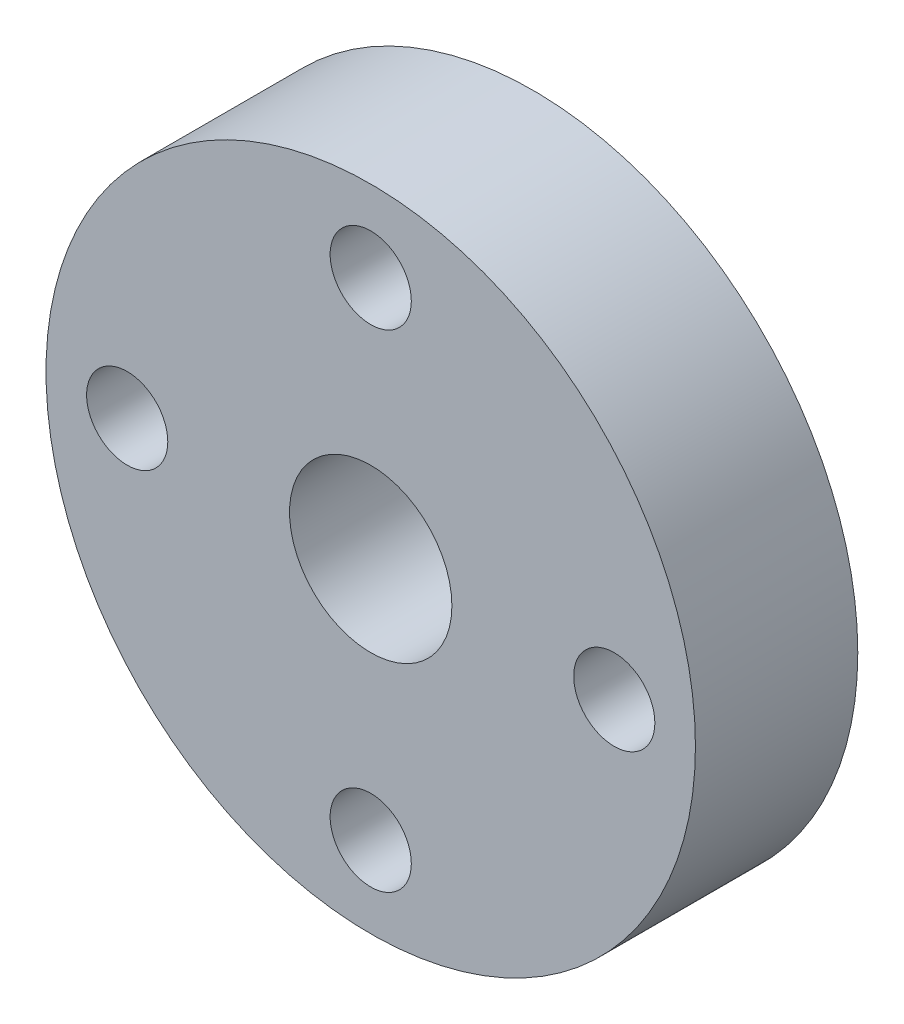
ISO-10303-21;
HEADER;
FILE_DESCRIPTION(('STEP AP214'),'2;1');
FILE_NAME('part.step','',(''),(''),'','','');
FILE_SCHEMA(('AUTOMOTIVE_DESIGN { 1 0 10303 214 1 1 1 1 }'));
ENDSEC;
DATA;
#1=APPLICATION_CONTEXT('core data for automotive mechanical design processes');
#2=APPLICATION_PROTOCOL_DEFINITION('international standard','automotive_design',2000,#1);
#3=PRODUCT_CONTEXT('',#1,'mechanical');
#4=PRODUCT('Part','Part','',(#3));
#5=PRODUCT_RELATED_PRODUCT_CATEGORY('part','',(#4));
#6=PRODUCT_DEFINITION_FORMATION('','',#4);
#7=PRODUCT_DEFINITION_CONTEXT('part definition',#1,'design');
#8=PRODUCT_DEFINITION('design','',#6,#7);
#9=PRODUCT_DEFINITION_SHAPE('','',#8);
#10=(LENGTH_UNIT() NAMED_UNIT(*) SI_UNIT(.MILLI.,.METRE.));
#11=(NAMED_UNIT(*) PLANE_ANGLE_UNIT() SI_UNIT($,.RADIAN.));
#12=(NAMED_UNIT(*) SI_UNIT($,.STERADIAN.) SOLID_ANGLE_UNIT());
#13=UNCERTAINTY_MEASURE_WITH_UNIT(LENGTH_MEASURE(1.E-05),#10,'distance_accuracy_value','');
#14=(GEOMETRIC_REPRESENTATION_CONTEXT(3) GLOBAL_UNCERTAINTY_ASSIGNED_CONTEXT((#13)) GLOBAL_UNIT_ASSIGNED_CONTEXT((#10,
#11,#12)) REPRESENTATION_CONTEXT('',''));
#15=CARTESIAN_POINT('',(0.,0.,0.));
#16=DIRECTION('',(0.,0.,1.));
#17=DIRECTION('',(1.,0.,0.));
#18=AXIS2_PLACEMENT_3D('',#15,#16,#17);
#19=CARTESIAN_POINT('',(0.,0.,10.));
#20=DIRECTION('',(0.,0.,1.));
#21=DIRECTION('',(1.,0.,0.));
#22=AXIS2_PLACEMENT_3D('',#19,#20,#21);
#23=PLANE('',#22);
#24=CARTESIAN_POINT('',(0.,-15.,10.));
#25=DIRECTION('',(0.,0.,1.));
#26=DIRECTION('',(1.,0.,0.));
#27=AXIS2_PLACEMENT_3D('',#24,#25,#26);
#28=CIRCLE('',#27,2.5000000000001);
#29=CARTESIAN_POINT('',(2.5000000000001,-15.,10.));
#30=VERTEX_POINT('',#29);
#31=EDGE_CURVE('E59',#30,#30,#28,.T.);
#32=ORIENTED_EDGE('',*,*,#31,.F.);
#33=EDGE_LOOP('',(#32));
#34=FACE_BOUND('',#33,.T.);
#35=CARTESIAN_POINT('',(0.,15.,10.));
#36=DIRECTION('',(0.,0.,1.));
#37=DIRECTION('',(1.,0.,0.));
#38=AXIS2_PLACEMENT_3D('',#35,#36,#37);
#39=CIRCLE('',#38,2.5);
#40=CARTESIAN_POINT('',(2.5,15.,10.));
#41=VERTEX_POINT('',#40);
#42=EDGE_CURVE('E47',#41,#41,#39,.T.);
#43=ORIENTED_EDGE('',*,*,#42,.F.);
#44=EDGE_LOOP('',(#43));
#45=FACE_BOUND('',#44,.T.);
#46=CARTESIAN_POINT('',(0.,0.,10.));
#47=DIRECTION('',(0.,0.,1.));
#48=DIRECTION('',(1.,0.,0.));
#49=AXIS2_PLACEMENT_3D('',#46,#47,#48);
#50=CIRCLE('',#49,20.);
#51=CARTESIAN_POINT('',(20.,0.,10.));
#52=VERTEX_POINT('',#51);
#53=EDGE_CURVE('E10',#52,#52,#50,.T.);
#54=ORIENTED_EDGE('',*,*,#53,.T.);
#55=EDGE_LOOP('',(#54));
#56=FACE_BOUND('',#55,.T.);
#57=CARTESIAN_POINT('',(0.,0.,10.));
#58=DIRECTION('',(0.,0.,1.));
#59=DIRECTION('',(1.,0.,0.));
#60=AXIS2_PLACEMENT_3D('',#57,#58,#59);
#61=CIRCLE('',#60,5.);
#62=CARTESIAN_POINT('',(5.,0.,10.));
#63=VERTEX_POINT('',#62);
#64=EDGE_CURVE('E42',#63,#63,#61,.T.);
#65=ORIENTED_EDGE('',*,*,#64,.F.);
#66=EDGE_LOOP('',(#65));
#67=FACE_BOUND('',#66,.T.);
#68=CARTESIAN_POINT('',(15.0000000000004,4.24488671257339E-13,10.));
#69=DIRECTION('',(0.,0.,1.));
#70=DIRECTION('',(1.,0.,0.));
#71=AXIS2_PLACEMENT_3D('',#68,#69,#70);
#72=CIRCLE('',#71,2.50000000000033);
#73=CARTESIAN_POINT('',(17.5000000000008,4.24488671257339E-13,10.));
#74=VERTEX_POINT('',#73);
#75=EDGE_CURVE('E53',#74,#74,#72,.T.);
#76=ORIENTED_EDGE('',*,*,#75,.F.);
#77=EDGE_LOOP('',(#76));
#78=FACE_BOUND('',#77,.T.);
#79=CARTESIAN_POINT('',(-15.,0.,10.));
#80=DIRECTION('',(0.,0.,1.));
#81=DIRECTION('',(1.,0.,0.));
#82=AXIS2_PLACEMENT_3D('',#79,#80,#81);
#83=CIRCLE('',#82,2.50000000000015);
#84=CARTESIAN_POINT('',(-12.4999999999999,0.,10.));
#85=VERTEX_POINT('',#84);
#86=EDGE_CURVE('E65',#85,#85,#83,.T.);
#87=ORIENTED_EDGE('',*,*,#86,.F.);
#88=EDGE_LOOP('',(#87));
#89=FACE_BOUND('',#88,.T.);
#90=ADVANCED_FACE('F31',(#34,#45,#56,#67,#78,#89),#23,.T.);
#91=CARTESIAN_POINT('',(0.,0.,0.));
#92=DIRECTION('',(0.,0.,1.));
#93=DIRECTION('',(1.,0.,0.));
#94=AXIS2_PLACEMENT_3D('',#91,#92,#93);
#95=PLANE('',#94);
#96=CARTESIAN_POINT('',(0.,0.,0.));
#97=DIRECTION('',(0.,0.,1.));
#98=DIRECTION('',(1.,0.,0.));
#99=AXIS2_PLACEMENT_3D('',#96,#97,#98);
#100=CIRCLE('',#99,20.);
#101=CARTESIAN_POINT('',(20.,0.,0.));
#102=VERTEX_POINT('',#101);
#103=EDGE_CURVE('E35',#102,#102,#100,.T.);
#104=ORIENTED_EDGE('',*,*,#103,.F.);
#105=EDGE_LOOP('',(#104));
#106=FACE_BOUND('',#105,.T.);
#107=CARTESIAN_POINT('',(0.,0.,0.));
#108=DIRECTION('',(0.,0.,1.));
#109=DIRECTION('',(1.,0.,0.));
#110=AXIS2_PLACEMENT_3D('',#107,#108,#109);
#111=CIRCLE('',#110,5.);
#112=CARTESIAN_POINT('',(5.,0.,0.));
#113=VERTEX_POINT('',#112);
#114=EDGE_CURVE('E44',#113,#113,#111,.T.);
#115=ORIENTED_EDGE('',*,*,#114,.T.);
#116=EDGE_LOOP('',(#115));
#117=FACE_BOUND('',#116,.T.);
#118=CARTESIAN_POINT('',(0.,15.,0.));
#119=DIRECTION('',(0.,0.,1.));
#120=DIRECTION('',(1.,0.,0.));
#121=AXIS2_PLACEMENT_3D('',#118,#119,#120);
#122=CIRCLE('',#121,2.5);
#123=CARTESIAN_POINT('',(2.5,15.,0.));
#124=VERTEX_POINT('',#123);
#125=EDGE_CURVE('E50',#124,#124,#122,.T.);
#126=ORIENTED_EDGE('',*,*,#125,.T.);
#127=EDGE_LOOP('',(#126));
#128=FACE_BOUND('',#127,.T.);
#129=CARTESIAN_POINT('',(15.0000000000004,4.24488671257339E-13,0.));
#130=DIRECTION('',(0.,0.,1.));
#131=DIRECTION('',(1.,0.,0.));
#132=AXIS2_PLACEMENT_3D('',#129,#130,#131);
#133=CIRCLE('',#132,2.50000000000033);
#134=CARTESIAN_POINT('',(17.5000000000008,4.24488671257339E-13,0.));
#135=VERTEX_POINT('',#134);
#136=EDGE_CURVE('E56',#135,#135,#133,.T.);
#137=ORIENTED_EDGE('',*,*,#136,.T.);
#138=EDGE_LOOP('',(#137));
#139=FACE_BOUND('',#138,.T.);
#140=CARTESIAN_POINT('',(0.,-15.,0.));
#141=DIRECTION('',(0.,0.,1.));
#142=DIRECTION('',(1.,0.,0.));
#143=AXIS2_PLACEMENT_3D('',#140,#141,#142);
#144=CIRCLE('',#143,2.5000000000001);
#145=CARTESIAN_POINT('',(2.5000000000001,-15.,0.));
#146=VERTEX_POINT('',#145);
#147=EDGE_CURVE('E62',#146,#146,#144,.T.);
#148=ORIENTED_EDGE('',*,*,#147,.T.);
#149=EDGE_LOOP('',(#148));
#150=FACE_BOUND('',#149,.T.);
#151=CARTESIAN_POINT('',(-15.,0.,0.));
#152=DIRECTION('',(0.,0.,1.));
#153=DIRECTION('',(1.,0.,0.));
#154=AXIS2_PLACEMENT_3D('',#151,#152,#153);
#155=CIRCLE('',#154,2.50000000000015);
#156=CARTESIAN_POINT('',(-12.4999999999999,0.,0.));
#157=VERTEX_POINT('',#156);
#158=EDGE_CURVE('E68',#157,#157,#155,.T.);
#159=ORIENTED_EDGE('',*,*,#158,.T.);
#160=EDGE_LOOP('',(#159));
#161=FACE_BOUND('',#160,.T.);
#162=ADVANCED_FACE('F78',(#106,#117,#128,#139,#150,#161),#95,.F.);
#163=CARTESIAN_POINT('',(0.,0.,10.));
#164=DIRECTION('',(0.,0.,-1.));
#165=DIRECTION('',(-1.,0.,0.));
#166=AXIS2_PLACEMENT_3D('',#163,#164,#165);
#167=CYLINDRICAL_SURFACE('',#166,20.);
#168=ORIENTED_EDGE('',*,*,#53,.F.);
#169=EDGE_LOOP('',(#168));
#170=FACE_BOUND('',#169,.T.);
#171=ORIENTED_EDGE('',*,*,#103,.T.);
#172=EDGE_LOOP('',(#171));
#173=FACE_BOUND('',#172,.T.);
#174=ADVANCED_FACE('F33',(#170,#173),#167,.T.);
#175=CARTESIAN_POINT('',(0.,0.,10.));
#176=DIRECTION('',(0.,0.,-1.));
#177=DIRECTION('',(-1.,0.,0.));
#178=AXIS2_PLACEMENT_3D('',#175,#176,#177);
#179=CYLINDRICAL_SURFACE('',#178,5.);
#180=ORIENTED_EDGE('',*,*,#64,.T.);
#181=EDGE_LOOP('',(#180));
#182=FACE_BOUND('',#181,.T.);
#183=ORIENTED_EDGE('',*,*,#114,.F.);
#184=EDGE_LOOP('',(#183));
#185=FACE_BOUND('',#184,.T.);
#186=ADVANCED_FACE('F88',(#182,#185),#179,.F.);
#187=CARTESIAN_POINT('',(0.,15.,10.));
#188=DIRECTION('',(0.,0.,-1.));
#189=DIRECTION('',(-1.,0.,0.));
#190=AXIS2_PLACEMENT_3D('',#187,#188,#189);
#191=CYLINDRICAL_SURFACE('',#190,2.5);
#192=ORIENTED_EDGE('',*,*,#42,.T.);
#193=EDGE_LOOP('',(#192));
#194=FACE_BOUND('',#193,.T.);
#195=ORIENTED_EDGE('',*,*,#125,.F.);
#196=EDGE_LOOP('',(#195));
#197=FACE_BOUND('',#196,.T.);
#198=ADVANCED_FACE('F91',(#194,#197),#191,.F.);
#199=CARTESIAN_POINT('',(15.0000000000004,4.24488671257339E-13,10.));
#200=DIRECTION('',(0.,0.,-1.));
#201=DIRECTION('',(-1.,0.,0.));
#202=AXIS2_PLACEMENT_3D('',#199,#200,#201);
#203=CYLINDRICAL_SURFACE('',#202,2.50000000000033);
#204=ORIENTED_EDGE('',*,*,#75,.T.);
#205=EDGE_LOOP('',(#204));
#206=FACE_BOUND('',#205,.T.);
#207=ORIENTED_EDGE('',*,*,#136,.F.);
#208=EDGE_LOOP('',(#207));
#209=FACE_BOUND('',#208,.T.);
#210=ADVANCED_FACE('F95',(#206,#209),#203,.F.);
#211=CARTESIAN_POINT('',(0.,-15.,10.));
#212=DIRECTION('',(0.,0.,-1.));
#213=DIRECTION('',(-1.,0.,0.));
#214=AXIS2_PLACEMENT_3D('',#211,#212,#213);
#215=CYLINDRICAL_SURFACE('',#214,2.5000000000001);
#216=ORIENTED_EDGE('',*,*,#31,.T.);
#217=EDGE_LOOP('',(#216));
#218=FACE_BOUND('',#217,.T.);
#219=ORIENTED_EDGE('',*,*,#147,.F.);
#220=EDGE_LOOP('',(#219));
#221=FACE_BOUND('',#220,.T.);
#222=ADVANCED_FACE('F99',(#218,#221),#215,.F.);
#223=CARTESIAN_POINT('',(-15.,0.,10.));
#224=DIRECTION('',(0.,0.,-1.));
#225=DIRECTION('',(-1.,0.,0.));
#226=AXIS2_PLACEMENT_3D('',#223,#224,#225);
#227=CYLINDRICAL_SURFACE('',#226,2.50000000000015);
#228=ORIENTED_EDGE('',*,*,#86,.T.);
#229=EDGE_LOOP('',(#228));
#230=FACE_BOUND('',#229,.T.);
#231=ORIENTED_EDGE('',*,*,#158,.F.);
#232=EDGE_LOOP('',(#231));
#233=FACE_BOUND('',#232,.T.);
#234=ADVANCED_FACE('F74',(#230,#233),#227,.F.);
#235=CLOSED_SHELL('',(#90,#162,#174,#186,#198,#210,#222,#234));
#236=MANIFOLD_SOLID_BREP('B2',#235);
#237=ADVANCED_BREP_SHAPE_REPRESENTATION('',(#18,#236),#14);
#238=SHAPE_DEFINITION_REPRESENTATION(#9,#237);
ENDSEC;
END-ISO-10303-21;
